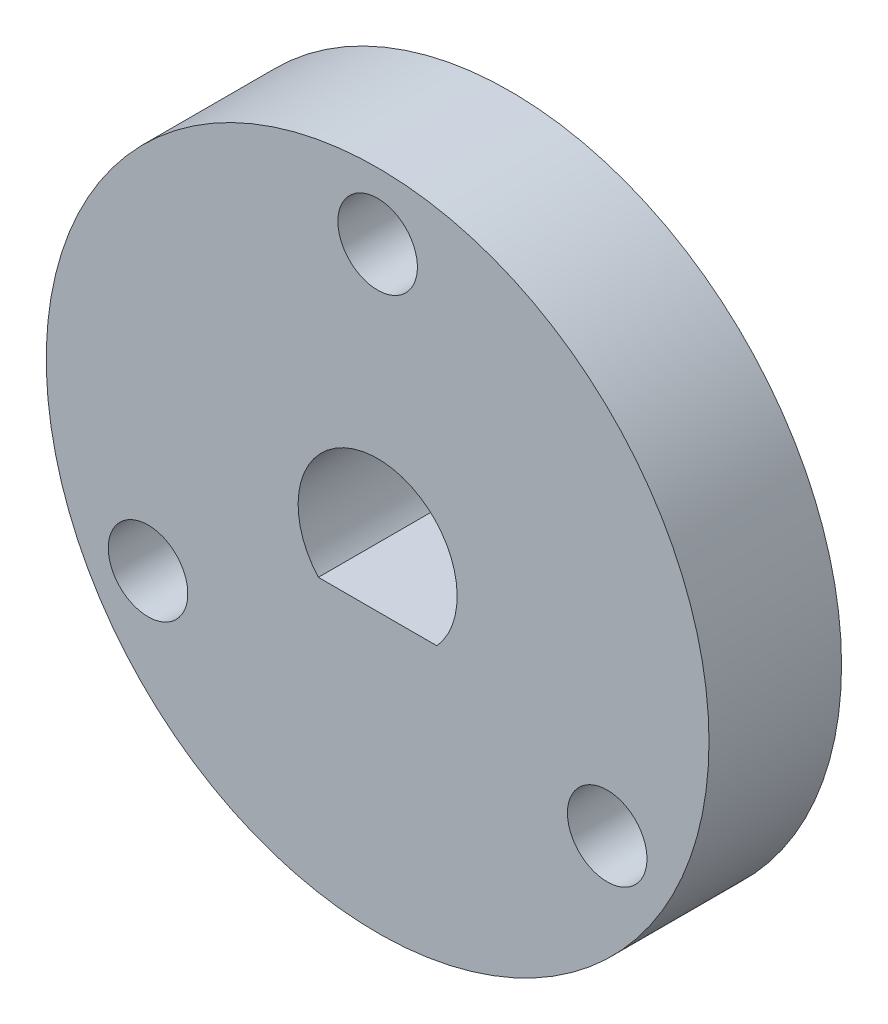
ISO-10303-21;
HEADER;
FILE_DESCRIPTION(('STEP AP214'),'2;1');
FILE_NAME('part.step','',(''),(''),'','','');
FILE_SCHEMA(('AUTOMOTIVE_DESIGN { 1 0 10303 214 1 1 1 1 }'));
ENDSEC;
DATA;
#1=APPLICATION_CONTEXT('core data for automotive mechanical design processes');
#2=APPLICATION_PROTOCOL_DEFINITION('international standard','automotive_design',2000,#1);
#3=PRODUCT_CONTEXT('',#1,'mechanical');
#4=PRODUCT('Part','Part','',(#3));
#5=PRODUCT_RELATED_PRODUCT_CATEGORY('part','',(#4));
#6=PRODUCT_DEFINITION_FORMATION('','',#4);
#7=PRODUCT_DEFINITION_CONTEXT('part definition',#1,'design');
#8=PRODUCT_DEFINITION('design','',#6,#7);
#9=PRODUCT_DEFINITION_SHAPE('','',#8);
#10=(LENGTH_UNIT() NAMED_UNIT(*) SI_UNIT(.MILLI.,.METRE.));
#11=(NAMED_UNIT(*) PLANE_ANGLE_UNIT() SI_UNIT($,.RADIAN.));
#12=(NAMED_UNIT(*) SI_UNIT($,.STERADIAN.) SOLID_ANGLE_UNIT());
#13=UNCERTAINTY_MEASURE_WITH_UNIT(LENGTH_MEASURE(1.E-05),#10,'distance_accuracy_value','');
#14=(GEOMETRIC_REPRESENTATION_CONTEXT(3) GLOBAL_UNCERTAINTY_ASSIGNED_CONTEXT((#13)) GLOBAL_UNIT_ASSIGNED_CONTEXT((#10,
#11,#12)) REPRESENTATION_CONTEXT('',''));
#15=CARTESIAN_POINT('',(0.,0.,0.));
#16=DIRECTION('',(0.,0.,1.));
#17=DIRECTION('',(1.,0.,0.));
#18=AXIS2_PLACEMENT_3D('',#15,#16,#17);
#19=CARTESIAN_POINT('',(0.,0.,-10.));
#20=DIRECTION('',(0.,0.,1.));
#21=DIRECTION('',(1.,0.,0.));
#22=AXIS2_PLACEMENT_3D('',#19,#20,#21);
#23=CYLINDRICAL_SURFACE('',#22,25.);
#24=CARTESIAN_POINT('',(0.,0.,-10.));
#25=DIRECTION('',(0.,0.,1.));
#26=DIRECTION('',(1.,0.,0.));
#27=AXIS2_PLACEMENT_3D('',#24,#25,#26);
#28=CIRCLE('',#27,25.);
#29=CARTESIAN_POINT('',(25.,0.,-10.));
#30=VERTEX_POINT('',#29);
#31=EDGE_CURVE('E11',#30,#30,#28,.T.);
#32=ORIENTED_EDGE('',*,*,#31,.T.);
#33=EDGE_LOOP('',(#32));
#34=FACE_BOUND('',#33,.T.);
#35=CARTESIAN_POINT('',(0.,0.,0.));
#36=DIRECTION('',(0.,0.,1.));
#37=DIRECTION('',(1.,0.,0.));
#38=AXIS2_PLACEMENT_3D('',#35,#36,#37);
#39=CIRCLE('',#38,25.);
#40=CARTESIAN_POINT('',(25.,0.,0.));
#41=VERTEX_POINT('',#40);
#42=EDGE_CURVE('E34',#41,#41,#39,.T.);
#43=ORIENTED_EDGE('',*,*,#42,.F.);
#44=EDGE_LOOP('',(#43));
#45=FACE_BOUND('',#44,.T.);
#46=ADVANCED_FACE('F31',(#34,#45),#23,.T.);
#47=CARTESIAN_POINT('',(0.,0.,-10.));
#48=DIRECTION('',(0.,0.,1.));
#49=DIRECTION('',(1.,0.,0.));
#50=AXIS2_PLACEMENT_3D('',#47,#48,#49);
#51=PLANE('',#50);
#52=CARTESIAN_POINT('',(17.3205080756889,-9.99999999999984,-10.));
#53=DIRECTION('',(0.,0.,-1.));
#54=DIRECTION('',(-1.,0.,0.));
#55=AXIS2_PLACEMENT_3D('',#52,#53,#54);
#56=CIRCLE('',#55,3.);
#57=CARTESIAN_POINT('',(14.3205080756889,-9.99999999999984,-10.));
#58=VERTEX_POINT('',#57);
#59=EDGE_CURVE('E90',#58,#58,#56,.T.);
#60=ORIENTED_EDGE('',*,*,#59,.F.);
#61=EDGE_LOOP('',(#60));
#62=FACE_BOUND('',#61,.T.);
#63=CARTESIAN_POINT('',(-17.3205080756887,-10.0000000000001,-10.));
#64=DIRECTION('',(0.,0.,-1.));
#65=DIRECTION('',(-1.,0.,0.));
#66=AXIS2_PLACEMENT_3D('',#63,#64,#65);
#67=CIRCLE('',#66,3.);
#68=CARTESIAN_POINT('',(-20.3205080756887,-10.0000000000001,-10.));
#69=VERTEX_POINT('',#68);
#70=EDGE_CURVE('E84',#69,#69,#67,.T.);
#71=ORIENTED_EDGE('',*,*,#70,.F.);
#72=EDGE_LOOP('',(#71));
#73=FACE_BOUND('',#72,.T.);
#74=CARTESIAN_POINT('',(0.,20.,-10.));
#75=DIRECTION('',(0.,0.,-1.));
#76=DIRECTION('',(-1.,0.,0.));
#77=AXIS2_PLACEMENT_3D('',#74,#75,#76);
#78=CIRCLE('',#77,3.);
#79=CARTESIAN_POINT('',(-3.,20.,-10.));
#80=VERTEX_POINT('',#79);
#81=EDGE_CURVE('E73',#80,#80,#78,.T.);
#82=ORIENTED_EDGE('',*,*,#81,.F.);
#83=EDGE_LOOP('',(#82));
#84=FACE_BOUND('',#83,.T.);
#85=DIRECTION('',(1.,0.,0.));
#86=VECTOR('',#85,1.);
#87=CARTESIAN_POINT('',(-4.47213595499958,-4.,-10.));
#88=LINE('',#87,#86);
#89=CARTESIAN_POINT('',(-4.47213595499958,-4.,-10.));
#90=VERTEX_POINT('',#89);
#91=CARTESIAN_POINT('',(4.47213595499958,-4.,-10.));
#92=VERTEX_POINT('',#91);
#93=EDGE_CURVE('E76',#90,#92,#88,.T.);
#94=ORIENTED_EDGE('',*,*,#93,.T.);
#95=CARTESIAN_POINT('',(0.,0.,-10.));
#96=DIRECTION('',(0.,0.,1.));
#97=DIRECTION('',(1.,0.,0.));
#98=AXIS2_PLACEMENT_3D('',#95,#96,#97);
#99=CIRCLE('',#98,6.);
#100=EDGE_CURVE('E45',#92,#90,#99,.T.);
#101=ORIENTED_EDGE('',*,*,#100,.T.);
#102=EDGE_LOOP('',(#94,#101));
#103=FACE_BOUND('',#102,.T.);
#104=ORIENTED_EDGE('',*,*,#31,.F.);
#105=EDGE_LOOP('',(#104));
#106=FACE_BOUND('',#105,.T.);
#107=ADVANCED_FACE('F105',(#62,#73,#84,#103,#106),#51,.F.);
#108=CARTESIAN_POINT('',(0.,0.,0.));
#109=DIRECTION('',(0.,0.,1.));
#110=DIRECTION('',(1.,0.,0.));
#111=AXIS2_PLACEMENT_3D('',#108,#109,#110);
#112=PLANE('',#111);
#113=CARTESIAN_POINT('',(17.3205080756889,-9.99999999999984,0.));
#114=DIRECTION('',(0.,0.,-1.));
#115=DIRECTION('',(-1.,0.,0.));
#116=AXIS2_PLACEMENT_3D('',#113,#114,#115);
#117=CIRCLE('',#116,3.);
#118=CARTESIAN_POINT('',(14.3205080756889,-9.99999999999984,0.));
#119=VERTEX_POINT('',#118);
#120=EDGE_CURVE('E87',#119,#119,#117,.T.);
#121=ORIENTED_EDGE('',*,*,#120,.T.);
#122=EDGE_LOOP('',(#121));
#123=FACE_BOUND('',#122,.T.);
#124=CARTESIAN_POINT('',(-17.3205080756887,-10.0000000000001,0.));
#125=DIRECTION('',(0.,0.,-1.));
#126=DIRECTION('',(-1.,0.,0.));
#127=AXIS2_PLACEMENT_3D('',#124,#125,#126);
#128=CIRCLE('',#127,3.);
#129=CARTESIAN_POINT('',(-20.3205080756887,-10.0000000000001,0.));
#130=VERTEX_POINT('',#129);
#131=EDGE_CURVE('E82',#130,#130,#128,.T.);
#132=ORIENTED_EDGE('',*,*,#131,.T.);
#133=EDGE_LOOP('',(#132));
#134=FACE_BOUND('',#133,.T.);
#135=CARTESIAN_POINT('',(0.,20.,0.));
#136=DIRECTION('',(0.,0.,-1.));
#137=DIRECTION('',(-1.,0.,0.));
#138=AXIS2_PLACEMENT_3D('',#135,#136,#137);
#139=CIRCLE('',#138,3.);
#140=CARTESIAN_POINT('',(-3.,20.,0.));
#141=VERTEX_POINT('',#140);
#142=EDGE_CURVE('E70',#141,#141,#139,.T.);
#143=ORIENTED_EDGE('',*,*,#142,.T.);
#144=EDGE_LOOP('',(#143));
#145=FACE_BOUND('',#144,.T.);
#146=CARTESIAN_POINT('',(0.,0.,0.));
#147=DIRECTION('',(0.,0.,1.));
#148=DIRECTION('',(1.,0.,0.));
#149=AXIS2_PLACEMENT_3D('',#146,#147,#148);
#150=CIRCLE('',#149,6.);
#151=CARTESIAN_POINT('',(4.47213595499958,-4.,0.));
#152=VERTEX_POINT('',#151);
#153=CARTESIAN_POINT('',(-4.47213595499958,-4.,0.));
#154=VERTEX_POINT('',#153);
#155=EDGE_CURVE('E50',#152,#154,#150,.T.);
#156=ORIENTED_EDGE('',*,*,#155,.F.);
#157=DIRECTION('',(1.,0.,0.));
#158=VECTOR('',#157,1.);
#159=CARTESIAN_POINT('',(-4.47213595499958,-4.,0.));
#160=LINE('',#159,#158);
#161=EDGE_CURVE('E64',#154,#152,#160,.T.);
#162=ORIENTED_EDGE('',*,*,#161,.F.);
#163=EDGE_LOOP('',(#156,#162));
#164=FACE_BOUND('',#163,.T.);
#165=ORIENTED_EDGE('',*,*,#42,.T.);
#166=EDGE_LOOP('',(#165));
#167=FACE_BOUND('',#166,.T.);
#168=ADVANCED_FACE('F68',(#123,#134,#145,#164,#167),#112,.T.);
#169=CARTESIAN_POINT('',(0.,0.,-10.));
#170=DIRECTION('',(0.,0.,1.));
#171=DIRECTION('',(1.,0.,0.));
#172=AXIS2_PLACEMENT_3D('',#169,#170,#171);
#173=CYLINDRICAL_SURFACE('',#172,6.);
#174=ORIENTED_EDGE('',*,*,#155,.T.);
#175=DIRECTION('',(0.,0.,1.));
#176=VECTOR('',#175,1.);
#177=CARTESIAN_POINT('',(-4.47213595499958,-4.,-10.));
#178=LINE('',#177,#176);
#179=EDGE_CURVE('E61',#90,#154,#178,.T.);
#180=ORIENTED_EDGE('',*,*,#179,.F.);
#181=ORIENTED_EDGE('',*,*,#100,.F.);
#182=DIRECTION('',(0.,0.,1.));
#183=VECTOR('',#182,1.);
#184=CARTESIAN_POINT('',(4.47213595499958,-4.,-10.));
#185=LINE('',#184,#183);
#186=EDGE_CURVE('E55',#92,#152,#185,.T.);
#187=ORIENTED_EDGE('',*,*,#186,.T.);
#188=EDGE_LOOP('',(#174,#180,#181,#187));
#189=FACE_BOUND('',#188,.T.);
#190=ADVANCED_FACE('F57',(#189),#173,.F.);
#191=CARTESIAN_POINT('',(-4.47213595499958,-4.,-10.));
#192=DIRECTION('',(0.,-1.,0.));
#193=DIRECTION('',(0.,0.,-1.));
#194=AXIS2_PLACEMENT_3D('',#191,#192,#193);
#195=PLANE('',#194);
#196=ORIENTED_EDGE('',*,*,#161,.T.);
#197=ORIENTED_EDGE('',*,*,#186,.F.);
#198=ORIENTED_EDGE('',*,*,#93,.F.);
#199=ORIENTED_EDGE('',*,*,#179,.T.);
#200=EDGE_LOOP('',(#196,#197,#198,#199));
#201=FACE_BOUND('',#200,.T.);
#202=ADVANCED_FACE('F65',(#201),#195,.F.);
#203=CARTESIAN_POINT('',(0.,20.,0.));
#204=DIRECTION('',(0.,0.,-1.));
#205=DIRECTION('',(-1.,0.,0.));
#206=AXIS2_PLACEMENT_3D('',#203,#204,#205);
#207=CYLINDRICAL_SURFACE('',#206,3.);
#208=ORIENTED_EDGE('',*,*,#142,.F.);
#209=EDGE_LOOP('',(#208));
#210=FACE_BOUND('',#209,.T.);
#211=ORIENTED_EDGE('',*,*,#81,.T.);
#212=EDGE_LOOP('',(#211));
#213=FACE_BOUND('',#212,.T.);
#214=ADVANCED_FACE('F127',(#210,#213),#207,.F.);
#215=CARTESIAN_POINT('',(-17.3205080756887,-10.0000000000001,0.));
#216=DIRECTION('',(0.,0.,-1.));
#217=DIRECTION('',(-1.,0.,0.));
#218=AXIS2_PLACEMENT_3D('',#215,#216,#217);
#219=CYLINDRICAL_SURFACE('',#218,3.);
#220=ORIENTED_EDGE('',*,*,#131,.F.);
#221=EDGE_LOOP('',(#220));
#222=FACE_BOUND('',#221,.T.);
#223=ORIENTED_EDGE('',*,*,#70,.T.);
#224=EDGE_LOOP('',(#223));
#225=FACE_BOUND('',#224,.T.);
#226=ADVANCED_FACE('F101',(#222,#225),#219,.F.);
#227=CARTESIAN_POINT('',(17.3205080756889,-9.99999999999984,0.));
#228=DIRECTION('',(0.,0.,-1.));
#229=DIRECTION('',(-1.,0.,0.));
#230=AXIS2_PLACEMENT_3D('',#227,#228,#229);
#231=CYLINDRICAL_SURFACE('',#230,3.);
#232=ORIENTED_EDGE('',*,*,#120,.F.);
#233=EDGE_LOOP('',(#232));
#234=FACE_BOUND('',#233,.T.);
#235=ORIENTED_EDGE('',*,*,#59,.T.);
#236=EDGE_LOOP('',(#235));
#237=FACE_BOUND('',#236,.T.);
#238=ADVANCED_FACE('F98',(#234,#237),#231,.F.);
#239=CLOSED_SHELL('',(#46,#107,#168,#190,#202,#214,#226,#238));
#240=MANIFOLD_SOLID_BREP('B2',#239);
#241=ADVANCED_BREP_SHAPE_REPRESENTATION('',(#18,#240),#14);
#242=SHAPE_DEFINITION_REPRESENTATION(#9,#241);
ENDSEC;
END-ISO-10303-21;
